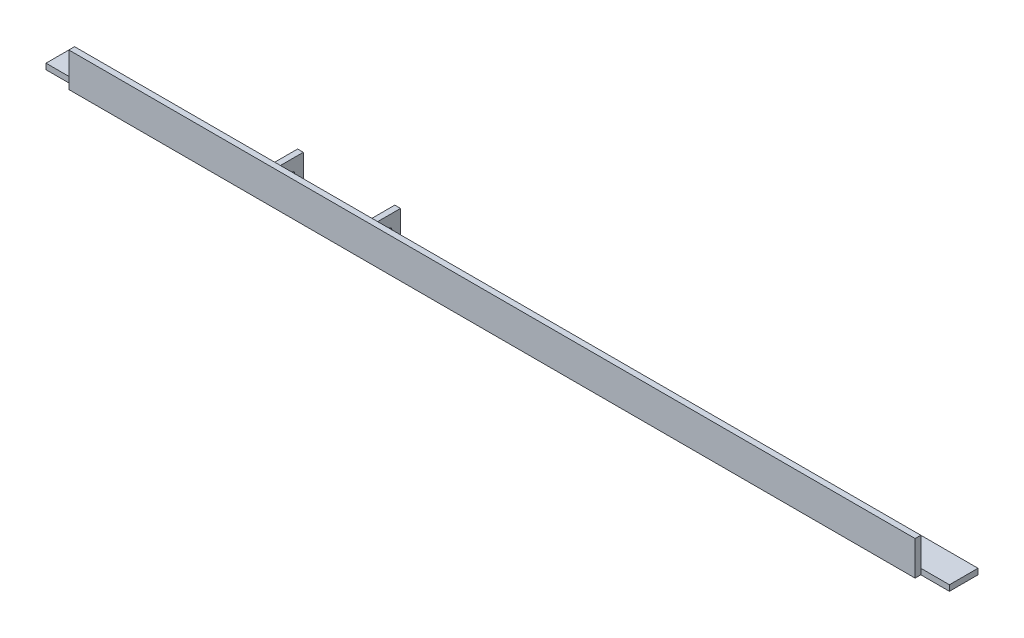
ISO-10303-21;
HEADER;
FILE_DESCRIPTION(('STEP AP214'),'2;1');
FILE_NAME('part.step','',(''),(''),'','','');
FILE_SCHEMA(('AUTOMOTIVE_DESIGN { 1 0 10303 214 1 1 1 1 }'));
ENDSEC;
DATA;
#1=APPLICATION_CONTEXT('core data for automotive mechanical design processes');
#2=APPLICATION_PROTOCOL_DEFINITION('international standard','automotive_design',2000,#1);
#3=PRODUCT_CONTEXT('',#1,'mechanical');
#4=PRODUCT('Part','Part','',(#3));
#5=PRODUCT_RELATED_PRODUCT_CATEGORY('part','',(#4));
#6=PRODUCT_DEFINITION_FORMATION('','',#4);
#7=PRODUCT_DEFINITION_CONTEXT('part definition',#1,'design');
#8=PRODUCT_DEFINITION('design','',#6,#7);
#9=PRODUCT_DEFINITION_SHAPE('','',#8);
#10=(LENGTH_UNIT() NAMED_UNIT(*) SI_UNIT(.MILLI.,.METRE.));
#11=(NAMED_UNIT(*) PLANE_ANGLE_UNIT() SI_UNIT($,.RADIAN.));
#12=(NAMED_UNIT(*) SI_UNIT($,.STERADIAN.) SOLID_ANGLE_UNIT());
#13=UNCERTAINTY_MEASURE_WITH_UNIT(LENGTH_MEASURE(1.E-05),#10,'distance_accuracy_value','');
#14=(GEOMETRIC_REPRESENTATION_CONTEXT(3) GLOBAL_UNCERTAINTY_ASSIGNED_CONTEXT((#13)) GLOBAL_UNIT_ASSIGNED_CONTEXT((#10,
#11,#12)) REPRESENTATION_CONTEXT('',''));
#15=CARTESIAN_POINT('',(0.,0.,0.));
#16=DIRECTION('',(0.,0.,1.));
#17=DIRECTION('',(1.,0.,0.));
#18=AXIS2_PLACEMENT_3D('',#15,#16,#17);
#19=CARTESIAN_POINT('',(1003.3,0.,0.));
#20=DIRECTION('',(-1.,0.,0.));
#21=DIRECTION('',(0.,0.,1.));
#22=AXIS2_PLACEMENT_3D('',#19,#20,#21);
#23=PLANE('',#22);
#24=DIRECTION('',(0.,1.,0.));
#25=VECTOR('',#24,1.);
#26=CARTESIAN_POINT('',(1003.3,-6.35000000000007,0.));
#27=LINE('',#26,#25);
#28=CARTESIAN_POINT('',(1003.3,-6.35,0.));
#29=VERTEX_POINT('',#28);
#30=CARTESIAN_POINT('',(1003.3,1.80411241501588E-13,0.));
#31=VERTEX_POINT('',#30);
#32=EDGE_CURVE('E498',#29,#31,#27,.T.);
#33=ORIENTED_EDGE('',*,*,#32,.F.);
#34=DIRECTION('',(0.,0.,-1.));
#35=VECTOR('',#34,1.);
#36=CARTESIAN_POINT('',(1003.3,-6.34999999999963,-31.75));
#37=LINE('',#36,#35);
#38=CARTESIAN_POINT('',(1003.3,-6.34999999999963,-31.75));
#39=VERTEX_POINT('',#38);
#40=EDGE_CURVE('E421',#29,#39,#37,.T.);
#41=ORIENTED_EDGE('',*,*,#40,.T.);
#42=DIRECTION('',(0.,1.,0.));
#43=VECTOR('',#42,1.);
#44=CARTESIAN_POINT('',(1003.3,3.60822483003176E-13,-31.7499999999999));
#45=LINE('',#44,#43);
#46=CARTESIAN_POINT('',(1003.3,3.60822483003176E-13,-31.7499999999999));
#47=VERTEX_POINT('',#46);
#48=EDGE_CURVE('E423',#39,#47,#45,.T.);
#49=ORIENTED_EDGE('',*,*,#48,.T.);
#50=DIRECTION('',(0.,0.,1.));
#51=VECTOR('',#50,1.);
#52=CARTESIAN_POINT('',(1003.3,0.,0.));
#53=LINE('',#52,#51);
#54=EDGE_CURVE('E230',#47,#31,#53,.T.);
#55=ORIENTED_EDGE('',*,*,#54,.T.);
#56=EDGE_LOOP('',(#33,#41,#49,#55));
#57=FACE_BOUND('',#56,.T.);
#58=ADVANCED_FACE('F44',(#57),#23,.F.);
#59=CARTESIAN_POINT('',(0.,0.,0.));
#60=DIRECTION('',(-1.,0.,0.));
#61=DIRECTION('',(0.,0.,1.));
#62=AXIS2_PLACEMENT_3D('',#59,#60,#61);
#63=PLANE('',#62);
#64=DIRECTION('',(0.,0.,-1.));
#65=VECTOR('',#64,1.);
#66=CARTESIAN_POINT('',(0.,-6.34999999999963,-31.75));
#67=LINE('',#66,#65);
#68=CARTESIAN_POINT('',(0.,-6.35000000000007,0.));
#69=VERTEX_POINT('',#68);
#70=CARTESIAN_POINT('',(0.,-6.34999999999963,-31.75));
#71=VERTEX_POINT('',#70);
#72=EDGE_CURVE('E214',#69,#71,#67,.T.);
#73=ORIENTED_EDGE('',*,*,#72,.F.);
#74=DIRECTION('',(0.,1.,0.));
#75=VECTOR('',#74,1.);
#76=CARTESIAN_POINT('',(0.,0.,0.));
#77=LINE('',#76,#75);
#78=CARTESIAN_POINT('',(0.,0.,0.));
#79=VERTEX_POINT('',#78);
#80=EDGE_CURVE('E11',#69,#79,#77,.T.);
#81=ORIENTED_EDGE('',*,*,#80,.T.);
#82=DIRECTION('',(0.,0.,1.));
#83=VECTOR('',#82,1.);
#84=CARTESIAN_POINT('',(0.,0.,0.));
#85=LINE('',#84,#83);
#86=CARTESIAN_POINT('',(0.,3.60822483003176E-13,-31.7499999999999));
#87=VERTEX_POINT('',#86);
#88=EDGE_CURVE('E226',#87,#79,#85,.T.);
#89=ORIENTED_EDGE('',*,*,#88,.F.);
#90=DIRECTION('',(0.,1.,0.));
#91=VECTOR('',#90,1.);
#92=CARTESIAN_POINT('',(0.,3.60822483003176E-13,-31.7499999999999));
#93=LINE('',#92,#91);
#94=EDGE_CURVE('E224',#71,#87,#93,.T.);
#95=ORIENTED_EDGE('',*,*,#94,.F.);
#96=EDGE_LOOP('',(#73,#81,#89,#95));
#97=FACE_BOUND('',#96,.T.);
#98=ADVANCED_FACE('F222',(#97),#63,.T.);
#99=CARTESIAN_POINT('',(1003.3,3.60822483003176E-13,-31.7499999999999));
#100=DIRECTION('',(0.,0.,1.));
#101=DIRECTION('',(0.,-1.,0.));
#102=AXIS2_PLACEMENT_3D('',#99,#100,#101);
#103=PLANE('',#102);
#104=DIRECTION('',(0.,-1.,0.));
#105=VECTOR('',#104,1.);
#106=CARTESIAN_POINT('',(254.,25.4000000000004,-31.7499999999996));
#107=LINE('',#106,#105);
#108=CARTESIAN_POINT('',(254.,25.4000000000004,-31.7499999999996));
#109=VERTEX_POINT('',#108);
#110=CARTESIAN_POINT('',(254.,-6.35000000000007,-31.75));
#111=VERTEX_POINT('',#110);
#112=EDGE_CURVE('E412',#109,#111,#107,.T.);
#113=ORIENTED_EDGE('',*,*,#112,.T.);
#114=DIRECTION('',(-1.,0.,0.));
#115=VECTOR('',#114,1.);
#116=CARTESIAN_POINT('',(1003.3,-6.34999999999963,-31.75));
#117=LINE('',#116,#115);
#118=EDGE_CURVE('E239',#111,#71,#117,.T.);
#119=ORIENTED_EDGE('',*,*,#118,.T.);
#120=ORIENTED_EDGE('',*,*,#94,.T.);
#121=DIRECTION('',(-1.,0.,0.));
#122=VECTOR('',#121,1.);
#123=CARTESIAN_POINT('',(1003.3,3.60822483003176E-13,-31.7499999999999));
#124=LINE('',#123,#122);
#125=CARTESIAN_POINT('',(247.65,3.60822483003176E-13,-31.7499999999999));
#126=VERTEX_POINT('',#125);
#127=EDGE_CURVE('E240',#126,#87,#124,.T.);
#128=ORIENTED_EDGE('',*,*,#127,.F.);
#129=DIRECTION('',(0.,-1.,0.));
#130=VECTOR('',#129,1.);
#131=CARTESIAN_POINT('',(247.65,25.4000000000004,-31.7499999999996));
#132=LINE('',#131,#130);
#133=CARTESIAN_POINT('',(247.65,25.4000000000004,-31.7499999999996));
#134=VERTEX_POINT('',#133);
#135=EDGE_CURVE('E408',#134,#126,#132,.T.);
#136=ORIENTED_EDGE('',*,*,#135,.F.);
#137=DIRECTION('',(-1.,0.,0.));
#138=VECTOR('',#137,1.);
#139=CARTESIAN_POINT('',(247.65,25.4000000000004,-31.7499999999996));
#140=LINE('',#139,#138);
#141=EDGE_CURVE('E370',#109,#134,#140,.T.);
#142=ORIENTED_EDGE('',*,*,#141,.F.);
#143=EDGE_LOOP('',(#113,#119,#120,#128,#136,#142));
#144=FACE_BOUND('',#143,.T.);
#145=ADVANCED_FACE('F434',(#144),#103,.F.);
#146=CARTESIAN_POINT('',(1003.3,0.,0.));
#147=DIRECTION('',(0.,-1.,0.));
#148=DIRECTION('',(0.,0.,-1.));
#149=AXIS2_PLACEMENT_3D('',#146,#147,#148);
#150=PLANE('',#149);
#151=DIRECTION('',(0.,0.,1.));
#152=VECTOR('',#151,1.);
#153=CARTESIAN_POINT('',(355.6,3.60822483003176E-13,-31.7499999999999));
#154=LINE('',#153,#152);
#155=CARTESIAN_POINT('',(355.6,1.4432899320127E-13,-12.6999999999999));
#156=VERTEX_POINT('',#155);
#157=CARTESIAN_POINT('',(355.6,0.,0.));
#158=VERTEX_POINT('',#157);
#159=EDGE_CURVE('E340',#156,#158,#154,.T.);
#160=ORIENTED_EDGE('',*,*,#159,.F.);
#161=DIRECTION('',(1.,0.,0.));
#162=VECTOR('',#161,1.);
#163=CARTESIAN_POINT('',(254.,1.4432899320127E-13,-12.6999999999999));
#164=LINE('',#163,#162);
#165=CARTESIAN_POINT('',(254.,1.4432899320127E-13,-12.6999999999999));
#166=VERTEX_POINT('',#165);
#167=EDGE_CURVE('E68',#166,#156,#164,.T.);
#168=ORIENTED_EDGE('',*,*,#167,.F.);
#169=DIRECTION('',(0.,0.,-1.));
#170=VECTOR('',#169,1.);
#171=CARTESIAN_POINT('',(254.,3.60822483003176E-13,-31.7499999999999));
#172=LINE('',#171,#170);
#173=CARTESIAN_POINT('',(254.,0.,0.));
#174=VERTEX_POINT('',#173);
#175=EDGE_CURVE('E343',#174,#166,#172,.T.);
#176=ORIENTED_EDGE('',*,*,#175,.F.);
#177=DIRECTION('',(-1.,0.,0.));
#178=VECTOR('',#177,1.);
#179=CARTESIAN_POINT('',(1003.3,0.,0.));
#180=LINE('',#179,#178);
#181=EDGE_CURVE('E442',#158,#174,#180,.T.);
#182=ORIENTED_EDGE('',*,*,#181,.F.);
#183=EDGE_LOOP('',(#160,#168,#176,#182));
#184=FACE_BOUND('',#183,.T.);
#185=ADVANCED_FACE('F46',(#184),#150,.F.);
#186=DIRECTION('',(0.,0.,-1.));
#187=VECTOR('',#186,1.);
#188=CARTESIAN_POINT('',(387.35,0.,-6.3499999999999));
#189=LINE('',#188,#187);
#190=CARTESIAN_POINT('',(387.35,0.,0.));
#191=VERTEX_POINT('',#190);
#192=CARTESIAN_POINT('',(387.35,0.,-6.3499999999999));
#193=VERTEX_POINT('',#192);
#194=EDGE_CURVE('E336',#191,#193,#189,.T.);
#195=ORIENTED_EDGE('',*,*,#194,.F.);
#196=CARTESIAN_POINT('',(971.55,0.,0.));
#197=VERTEX_POINT('',#196);
#198=EDGE_CURVE('E258',#197,#191,#180,.T.);
#199=ORIENTED_EDGE('',*,*,#198,.F.);
#200=EDGE_CURVE('E53',#31,#197,#180,.T.);
#201=ORIENTED_EDGE('',*,*,#200,.F.);
#202=ORIENTED_EDGE('',*,*,#54,.F.);
#203=CARTESIAN_POINT('',(361.95,3.60822483003176E-13,-31.7499999999999));
#204=VERTEX_POINT('',#203);
#205=EDGE_CURVE('E236',#47,#204,#124,.T.);
#206=ORIENTED_EDGE('',*,*,#205,.T.);
#207=DIRECTION('',(0.,0.,-1.));
#208=VECTOR('',#207,1.);
#209=CARTESIAN_POINT('',(361.95,3.60822483003176E-13,-31.7499999999999));
#210=LINE('',#209,#208);
#211=CARTESIAN_POINT('',(361.95,0.,-6.34999999999971));
#212=VERTEX_POINT('',#211);
#213=EDGE_CURVE('E327',#212,#204,#210,.T.);
#214=ORIENTED_EDGE('',*,*,#213,.F.);
#215=DIRECTION('',(-1.,0.,0.));
#216=VECTOR('',#215,1.);
#217=CARTESIAN_POINT('',(387.35,0.,-6.3499999999999));
#218=LINE('',#217,#216);
#219=EDGE_CURVE('E331',#193,#212,#218,.T.);
#220=ORIENTED_EDGE('',*,*,#219,.F.);
#221=EDGE_LOOP('',(#195,#199,#201,#202,#206,#214,#220));
#222=FACE_BOUND('',#221,.T.);
#223=ADVANCED_FACE('F453',(#222),#150,.F.);
#224=CARTESIAN_POINT('',(1003.3,0.,0.));
#225=DIRECTION('',(0.,0.,1.));
#226=DIRECTION('',(0.,-1.,0.));
#227=AXIS2_PLACEMENT_3D('',#224,#225,#226);
#228=PLANE('',#227);
#229=CARTESIAN_POINT('',(222.25,0.,0.));
#230=VERTEX_POINT('',#229);
#231=CARTESIAN_POINT('',(31.75,0.,0.));
#232=VERTEX_POINT('',#231);
#233=EDGE_CURVE('E256',#230,#232,#180,.T.);
#234=ORIENTED_EDGE('',*,*,#233,.T.);
#235=DIRECTION('',(0.,1.,0.));
#236=VECTOR('',#235,1.);
#237=CARTESIAN_POINT('',(31.75,31.7499999999999,0.));
#238=LINE('',#237,#236);
#239=CARTESIAN_POINT('',(31.75,31.7499999999999,0.));
#240=VERTEX_POINT('',#239);
#241=EDGE_CURVE('E218',#232,#240,#238,.T.);
#242=ORIENTED_EDGE('',*,*,#241,.T.);
#243=DIRECTION('',(-1.,0.,0.));
#244=VECTOR('',#243,1.);
#245=CARTESIAN_POINT('',(1003.3,31.7499999999999,0.));
#246=LINE('',#245,#244);
#247=CARTESIAN_POINT('',(971.55,31.7499999999999,0.));
#248=VERTEX_POINT('',#247);
#249=EDGE_CURVE('E252',#248,#240,#246,.T.);
#250=ORIENTED_EDGE('',*,*,#249,.F.);
#251=DIRECTION('',(0.,-1.,0.));
#252=VECTOR('',#251,1.);
#253=CARTESIAN_POINT('',(971.55,-6.35000000000007,0.));
#254=LINE('',#253,#252);
#255=EDGE_CURVE('E450',#248,#197,#254,.T.);
#256=ORIENTED_EDGE('',*,*,#255,.T.);
#257=ORIENTED_EDGE('',*,*,#198,.T.);
#258=DIRECTION('',(0.,-1.,0.));
#259=VECTOR('',#258,1.);
#260=CARTESIAN_POINT('',(387.35,25.4,3.86400264115041E-13));
#261=LINE('',#260,#259);
#262=CARTESIAN_POINT('',(387.35,25.4,0.));
#263=VERTEX_POINT('',#262);
#264=EDGE_CURVE('E307',#263,#191,#261,.T.);
#265=ORIENTED_EDGE('',*,*,#264,.F.);
#266=DIRECTION('',(1.,0.,0.));
#267=VECTOR('',#266,1.);
#268=CARTESIAN_POINT('',(387.35,25.4,3.86400264115041E-13));
#269=LINE('',#268,#267);
#270=CARTESIAN_POINT('',(355.6,25.4,0.));
#271=VERTEX_POINT('',#270);
#272=EDGE_CURVE('E355',#271,#263,#269,.T.);
#273=ORIENTED_EDGE('',*,*,#272,.F.);
#274=DIRECTION('',(0.,-1.,0.));
#275=VECTOR('',#274,1.);
#276=CARTESIAN_POINT('',(355.6,25.4,2.76215574923204E-13));
#277=LINE('',#276,#275);
#278=EDGE_CURVE('E301',#271,#158,#277,.T.);
#279=ORIENTED_EDGE('',*,*,#278,.T.);
#280=ORIENTED_EDGE('',*,*,#181,.T.);
#281=DIRECTION('',(0.,-1.,0.));
#282=VECTOR('',#281,1.);
#283=CARTESIAN_POINT('',(254.,25.4,2.88657986402541E-13));
#284=LINE('',#283,#282);
#285=CARTESIAN_POINT('',(254.,25.4,0.));
#286=VERTEX_POINT('',#285);
#287=EDGE_CURVE('E232',#286,#174,#284,.T.);
#288=ORIENTED_EDGE('',*,*,#287,.F.);
#289=DIRECTION('',(1.,0.,0.));
#290=VECTOR('',#289,1.);
#291=CARTESIAN_POINT('',(222.25,25.4,3.78863607153335E-13));
#292=LINE('',#291,#290);
#293=CARTESIAN_POINT('',(222.25,25.4,0.));
#294=VERTEX_POINT('',#293);
#295=EDGE_CURVE('E362',#294,#286,#292,.T.);
#296=ORIENTED_EDGE('',*,*,#295,.F.);
#297=DIRECTION('',(0.,-1.,0.));
#298=VECTOR('',#297,1.);
#299=CARTESIAN_POINT('',(222.25,25.4,3.78863607153335E-13));
#300=LINE('',#299,#298);
#301=EDGE_CURVE('E383',#294,#230,#300,.T.);
#302=ORIENTED_EDGE('',*,*,#301,.T.);
#303=EDGE_LOOP('',(#234,#242,#250,#256,#257,#265,#273,#279,#280,#288,#296,#302));
#304=FACE_BOUND('',#303,.T.);
#305=ADVANCED_FACE('F448',(#304),#228,.F.);
#306=DIRECTION('',(0.,0.,1.));
#307=VECTOR('',#306,1.);
#308=CARTESIAN_POINT('',(247.65,3.60822483003176E-13,-31.7499999999999));
#309=LINE('',#308,#307);
#310=CARTESIAN_POINT('',(247.65,0.,-6.34999999999998));
#311=VERTEX_POINT('',#310);
#312=EDGE_CURVE('E387',#126,#311,#309,.T.);
#313=ORIENTED_EDGE('',*,*,#312,.F.);
#314=ORIENTED_EDGE('',*,*,#127,.T.);
#315=ORIENTED_EDGE('',*,*,#88,.T.);
#316=DIRECTION('',(-1.,0.,0.));
#317=VECTOR('',#316,1.);
#318=CARTESIAN_POINT('',(1003.3,0.,0.));
#319=LINE('',#318,#317);
#320=EDGE_CURVE('E205',#232,#79,#319,.T.);
#321=ORIENTED_EDGE('',*,*,#320,.F.);
#322=ORIENTED_EDGE('',*,*,#233,.F.);
#323=DIRECTION('',(0.,0.,1.));
#324=VECTOR('',#323,1.);
#325=CARTESIAN_POINT('',(222.25,0.,-6.3499999999999));
#326=LINE('',#325,#324);
#327=CARTESIAN_POINT('',(222.25,0.,-6.3499999999999));
#328=VERTEX_POINT('',#327);
#329=EDGE_CURVE('E367',#328,#230,#326,.T.);
#330=ORIENTED_EDGE('',*,*,#329,.F.);
#331=DIRECTION('',(-1.,0.,0.));
#332=VECTOR('',#331,1.);
#333=CARTESIAN_POINT('',(222.25,0.,-6.3499999999999));
#334=LINE('',#333,#332);
#335=EDGE_CURVE('E391',#311,#328,#334,.T.);
#336=ORIENTED_EDGE('',*,*,#335,.F.);
#337=EDGE_LOOP('',(#313,#314,#315,#321,#322,#330,#336));
#338=FACE_BOUND('',#337,.T.);
#339=ADVANCED_FACE('F431',(#338),#150,.F.);
#340=CARTESIAN_POINT('',(1003.3,31.7499999999999,0.));
#341=DIRECTION('',(0.,-1.,0.));
#342=DIRECTION('',(0.,0.,-1.));
#343=AXIS2_PLACEMENT_3D('',#340,#341,#342);
#344=PLANE('',#343);
#345=ORIENTED_EDGE('',*,*,#249,.T.);
#346=DIRECTION('',(0.,0.,1.));
#347=VECTOR('',#346,1.);
#348=CARTESIAN_POINT('',(31.75,31.7499999999999,0.));
#349=LINE('',#348,#347);
#350=CARTESIAN_POINT('',(31.75,31.7499999999999,6.35));
#351=VERTEX_POINT('',#350);
#352=EDGE_CURVE('E276',#240,#351,#349,.T.);
#353=ORIENTED_EDGE('',*,*,#352,.T.);
#354=DIRECTION('',(-1.,0.,0.));
#355=VECTOR('',#354,1.);
#356=CARTESIAN_POINT('',(1003.3,31.7499999999999,6.35));
#357=LINE('',#356,#355);
#358=CARTESIAN_POINT('',(971.55,31.7499999999999,6.35));
#359=VERTEX_POINT('',#358);
#360=EDGE_CURVE('E248',#359,#351,#357,.T.);
#361=ORIENTED_EDGE('',*,*,#360,.F.);
#362=DIRECTION('',(0.,0.,1.));
#363=VECTOR('',#362,1.);
#364=CARTESIAN_POINT('',(971.55,31.7499999999999,0.));
#365=LINE('',#364,#363);
#366=EDGE_CURVE('E509',#248,#359,#365,.T.);
#367=ORIENTED_EDGE('',*,*,#366,.F.);
#368=EDGE_LOOP('',(#345,#353,#361,#367));
#369=FACE_BOUND('',#368,.T.);
#370=ADVANCED_FACE('F530',(#369),#344,.F.);
#371=CARTESIAN_POINT('',(1003.3,31.7499999999999,6.35));
#372=DIRECTION('',(0.,0.,-1.));
#373=DIRECTION('',(-1.,0.,0.));
#374=AXIS2_PLACEMENT_3D('',#371,#372,#373);
#375=PLANE('',#374);
#376=ORIENTED_EDGE('',*,*,#360,.T.);
#377=DIRECTION('',(0.,1.,0.));
#378=VECTOR('',#377,1.);
#379=CARTESIAN_POINT('',(31.75,31.7499999999999,6.35));
#380=LINE('',#379,#378);
#381=CARTESIAN_POINT('',(31.7499999999999,-6.35000000000007,6.35));
#382=VERTEX_POINT('',#381);
#383=EDGE_CURVE('E219',#382,#351,#380,.T.);
#384=ORIENTED_EDGE('',*,*,#383,.F.);
#385=DIRECTION('',(-1.,0.,0.));
#386=VECTOR('',#385,1.);
#387=CARTESIAN_POINT('',(1003.3,-6.35000000000007,6.35));
#388=LINE('',#387,#386);
#389=CARTESIAN_POINT('',(971.55,-6.35000000000007,6.35));
#390=VERTEX_POINT('',#389);
#391=EDGE_CURVE('E245',#390,#382,#388,.T.);
#392=ORIENTED_EDGE('',*,*,#391,.F.);
#393=DIRECTION('',(0.,-1.,0.));
#394=VECTOR('',#393,1.);
#395=CARTESIAN_POINT('',(971.55,-6.35000000000007,6.35));
#396=LINE('',#395,#394);
#397=EDGE_CURVE('E501',#359,#390,#396,.T.);
#398=ORIENTED_EDGE('',*,*,#397,.F.);
#399=EDGE_LOOP('',(#376,#384,#392,#398));
#400=FACE_BOUND('',#399,.T.);
#401=ADVANCED_FACE('F539',(#400),#375,.F.);
#402=CARTESIAN_POINT('',(1003.3,-6.34999999999963,-31.75));
#403=DIRECTION('',(0.,1.,0.));
#404=DIRECTION('',(0.,0.,1.));
#405=AXIS2_PLACEMENT_3D('',#402,#403,#404);
#406=PLANE('',#405);
#407=ORIENTED_EDGE('',*,*,#391,.T.);
#408=DIRECTION('',(0.,0.,1.));
#409=VECTOR('',#408,1.);
#410=CARTESIAN_POINT('',(31.7499999999999,-6.35000000000007,0.));
#411=LINE('',#410,#409);
#412=CARTESIAN_POINT('',(31.7499999999999,-6.35000000000007,0.));
#413=VERTEX_POINT('',#412);
#414=EDGE_CURVE('E216',#413,#382,#411,.T.);
#415=ORIENTED_EDGE('',*,*,#414,.F.);
#416=DIRECTION('',(1.,0.,0.));
#417=VECTOR('',#416,1.);
#418=CARTESIAN_POINT('',(0.,-6.35000000000007,0.));
#419=LINE('',#418,#417);
#420=EDGE_CURVE('E202',#69,#413,#419,.T.);
#421=ORIENTED_EDGE('',*,*,#420,.F.);
#422=ORIENTED_EDGE('',*,*,#72,.T.);
#423=ORIENTED_EDGE('',*,*,#118,.F.);
#424=DIRECTION('',(0.,0.,1.));
#425=VECTOR('',#424,1.);
#426=CARTESIAN_POINT('',(254.,-6.35000000000007,-31.75));
#427=LINE('',#426,#425);
#428=CARTESIAN_POINT('',(254.,-6.35000000000029,-12.7));
#429=VERTEX_POINT('',#428);
#430=EDGE_CURVE('E283',#111,#429,#427,.T.);
#431=ORIENTED_EDGE('',*,*,#430,.T.);
#432=DIRECTION('',(1.,0.,0.));
#433=VECTOR('',#432,1.);
#434=CARTESIAN_POINT('',(254.,-6.35000000000029,-12.7));
#435=LINE('',#434,#433);
#436=CARTESIAN_POINT('',(355.6,-6.35000000000029,-12.7));
#437=VERTEX_POINT('',#436);
#438=EDGE_CURVE('E287',#429,#437,#435,.T.);
#439=ORIENTED_EDGE('',*,*,#438,.T.);
#440=DIRECTION('',(0.,0.,-1.));
#441=VECTOR('',#440,1.);
#442=CARTESIAN_POINT('',(355.6,-6.35000000000007,-31.75));
#443=LINE('',#442,#441);
#444=CARTESIAN_POINT('',(355.6,-6.35000000000007,-31.75));
#445=VERTEX_POINT('',#444);
#446=EDGE_CURVE('E291',#437,#445,#443,.T.);
#447=ORIENTED_EDGE('',*,*,#446,.T.);
#448=EDGE_CURVE('E241',#39,#445,#117,.T.);
#449=ORIENTED_EDGE('',*,*,#448,.F.);
#450=ORIENTED_EDGE('',*,*,#40,.F.);
#451=DIRECTION('',(1.,0.,0.));
#452=VECTOR('',#451,1.);
#453=CARTESIAN_POINT('',(1003.3,-6.35000000000007,0.));
#454=LINE('',#453,#452);
#455=CARTESIAN_POINT('',(971.55,-6.35000000000007,0.));
#456=VERTEX_POINT('',#455);
#457=EDGE_CURVE('E60',#456,#29,#454,.T.);
#458=ORIENTED_EDGE('',*,*,#457,.F.);
#459=DIRECTION('',(0.,0.,1.));
#460=VECTOR('',#459,1.);
#461=CARTESIAN_POINT('',(971.55,-6.35000000000007,0.));
#462=LINE('',#461,#460);
#463=EDGE_CURVE('E511',#456,#390,#462,.T.);
#464=ORIENTED_EDGE('',*,*,#463,.T.);
#465=EDGE_LOOP('',(#407,#415,#421,#422,#423,#431,#439,#447,#449,#450,#458,#464));
#466=FACE_BOUND('',#465,.T.);
#467=ADVANCED_FACE('F212',(#466),#406,.F.);
#468=ORIENTED_EDGE('',*,*,#448,.T.);
#469=DIRECTION('',(0.,-1.,0.));
#470=VECTOR('',#469,1.);
#471=CARTESIAN_POINT('',(355.6,25.4000000000004,-31.7499999999997));
#472=LINE('',#471,#470);
#473=CARTESIAN_POINT('',(355.6,25.4000000000004,-31.7499999999997));
#474=VERTEX_POINT('',#473);
#475=EDGE_CURVE('E323',#474,#445,#472,.T.);
#476=ORIENTED_EDGE('',*,*,#475,.F.);
#477=DIRECTION('',(-1.,0.,0.));
#478=VECTOR('',#477,1.);
#479=CARTESIAN_POINT('',(361.95,25.4000000000004,-31.7499999999997));
#480=LINE('',#479,#478);
#481=CARTESIAN_POINT('',(361.95,25.4000000000004,-31.7499999999997));
#482=VERTEX_POINT('',#481);
#483=EDGE_CURVE('E326',#482,#474,#480,.T.);
#484=ORIENTED_EDGE('',*,*,#483,.F.);
#485=DIRECTION('',(0.,-1.,0.));
#486=VECTOR('',#485,1.);
#487=CARTESIAN_POINT('',(361.95,25.4000000000004,-31.7499999999997));
#488=LINE('',#487,#486);
#489=EDGE_CURVE('E319',#482,#204,#488,.T.);
#490=ORIENTED_EDGE('',*,*,#489,.T.);
#491=ORIENTED_EDGE('',*,*,#205,.F.);
#492=ORIENTED_EDGE('',*,*,#48,.F.);
#493=EDGE_LOOP('',(#468,#476,#484,#490,#491,#492));
#494=FACE_BOUND('',#493,.T.);
#495=ADVANCED_FACE('F495',(#494),#103,.F.);
#496=CARTESIAN_POINT('',(254.,25.4000000000004,-31.7499999999996));
#497=DIRECTION('',(-1.,0.,0.));
#498=DIRECTION('',(0.,0.,1.));
#499=AXIS2_PLACEMENT_3D('',#496,#497,#498);
#500=PLANE('',#499);
#501=CARTESIAN_POINT('',(254.,9.52500000000036,-19.0499999999996));
#502=DIRECTION('',(-1.,0.,0.));
#503=DIRECTION('',(0.,0.,1.));
#504=AXIS2_PLACEMENT_3D('',#501,#502,#503);
#505=CIRCLE('',#504,3.175);
#506=CARTESIAN_POINT('',(254.,9.52500000000036,-15.8749999999996));
#507=VERTEX_POINT('',#506);
#508=EDGE_CURVE('E269',#507,#507,#505,.T.);
#509=ORIENTED_EDGE('',*,*,#508,.T.);
#510=EDGE_LOOP('',(#509));
#511=FACE_BOUND('',#510,.T.);
#512=ORIENTED_EDGE('',*,*,#175,.T.);
#513=DIRECTION('',(0.,1.,0.));
#514=VECTOR('',#513,1.);
#515=CARTESIAN_POINT('',(254.,-6.35000000000029,-12.7));
#516=LINE('',#515,#514);
#517=EDGE_CURVE('E295',#429,#166,#516,.T.);
#518=ORIENTED_EDGE('',*,*,#517,.F.);
#519=ORIENTED_EDGE('',*,*,#430,.F.);
#520=ORIENTED_EDGE('',*,*,#112,.F.);
#521=DIRECTION('',(0.,0.,-1.));
#522=VECTOR('',#521,1.);
#523=CARTESIAN_POINT('',(254.,25.4000000000004,-31.7499999999996));
#524=LINE('',#523,#522);
#525=EDGE_CURVE('E366',#286,#109,#524,.T.);
#526=ORIENTED_EDGE('',*,*,#525,.F.);
#527=ORIENTED_EDGE('',*,*,#287,.T.);
#528=EDGE_LOOP('',(#512,#518,#519,#520,#526,#527));
#529=FACE_BOUND('',#528,.T.);
#530=ADVANCED_FACE('F471',(#511,#529),#500,.F.);
#531=CARTESIAN_POINT('',(247.65,25.4000000000004,-31.7499999999996));
#532=DIRECTION('',(1.,0.,0.));
#533=DIRECTION('',(0.,0.,-1.));
#534=AXIS2_PLACEMENT_3D('',#531,#532,#533);
#535=PLANE('',#534);
#536=CARTESIAN_POINT('',(247.65,9.52500000000036,-19.0499999999996));
#537=DIRECTION('',(-1.,0.,0.));
#538=DIRECTION('',(0.,0.,1.));
#539=AXIS2_PLACEMENT_3D('',#536,#537,#538);
#540=CIRCLE('',#539,3.175);
#541=CARTESIAN_POINT('',(247.65,9.52500000000036,-15.8749999999996));
#542=VERTEX_POINT('',#541);
#543=EDGE_CURVE('E263',#542,#542,#540,.T.);
#544=ORIENTED_EDGE('',*,*,#543,.F.);
#545=EDGE_LOOP('',(#544));
#546=FACE_BOUND('',#545,.T.);
#547=ORIENTED_EDGE('',*,*,#312,.T.);
#548=DIRECTION('',(0.,-1.,0.));
#549=VECTOR('',#548,1.);
#550=CARTESIAN_POINT('',(247.65,25.4000000000001,-6.34999999999969));
#551=LINE('',#550,#549);
#552=CARTESIAN_POINT('',(247.65,25.4000000000001,-6.34999999999969));
#553=VERTEX_POINT('',#552);
#554=EDGE_CURVE('E404',#553,#311,#551,.T.);
#555=ORIENTED_EDGE('',*,*,#554,.F.);
#556=DIRECTION('',(0.,0.,1.));
#557=VECTOR('',#556,1.);
#558=CARTESIAN_POINT('',(247.65,25.4000000000004,-31.7499999999996));
#559=LINE('',#558,#557);
#560=EDGE_CURVE('E373',#134,#553,#559,.T.);
#561=ORIENTED_EDGE('',*,*,#560,.F.);
#562=ORIENTED_EDGE('',*,*,#135,.T.);
#563=EDGE_LOOP('',(#547,#555,#561,#562));
#564=FACE_BOUND('',#563,.T.);
#565=ADVANCED_FACE('F486',(#546,#564),#535,.F.);
#566=CARTESIAN_POINT('',(222.25,25.4000000000001,-6.34999999999961));
#567=DIRECTION('',(0.,0.,1.));
#568=DIRECTION('',(0.,-1.,0.));
#569=AXIS2_PLACEMENT_3D('',#566,#567,#568);
#570=PLANE('',#569);
#571=ORIENTED_EDGE('',*,*,#335,.T.);
#572=DIRECTION('',(0.,-1.,0.));
#573=VECTOR('',#572,1.);
#574=CARTESIAN_POINT('',(222.25,25.4000000000001,-6.34999999999961));
#575=LINE('',#574,#573);
#576=CARTESIAN_POINT('',(222.25,25.4000000000001,-6.34999999999961));
#577=VERTEX_POINT('',#576);
#578=EDGE_CURVE('E400',#577,#328,#575,.T.);
#579=ORIENTED_EDGE('',*,*,#578,.F.);
#580=DIRECTION('',(-1.,0.,0.));
#581=VECTOR('',#580,1.);
#582=CARTESIAN_POINT('',(222.25,25.4000000000001,-6.34999999999961));
#583=LINE('',#582,#581);
#584=EDGE_CURVE('E376',#553,#577,#583,.T.);
#585=ORIENTED_EDGE('',*,*,#584,.F.);
#586=ORIENTED_EDGE('',*,*,#554,.T.);
#587=EDGE_LOOP('',(#571,#579,#585,#586));
#588=FACE_BOUND('',#587,.T.);
#589=ADVANCED_FACE('F482',(#588),#570,.F.);
#590=CARTESIAN_POINT('',(222.25,25.4000000000001,-6.34999999999961));
#591=DIRECTION('',(1.,0.,0.));
#592=DIRECTION('',(0.,0.,-1.));
#593=AXIS2_PLACEMENT_3D('',#590,#591,#592);
#594=PLANE('',#593);
#595=ORIENTED_EDGE('',*,*,#329,.T.);
#596=ORIENTED_EDGE('',*,*,#301,.F.);
#597=DIRECTION('',(0.,0.,1.));
#598=VECTOR('',#597,1.);
#599=CARTESIAN_POINT('',(222.25,25.4000000000001,-6.34999999999961));
#600=LINE('',#599,#598);
#601=EDGE_CURVE('E379',#577,#294,#600,.T.);
#602=ORIENTED_EDGE('',*,*,#601,.F.);
#603=ORIENTED_EDGE('',*,*,#578,.T.);
#604=EDGE_LOOP('',(#595,#596,#602,#603));
#605=FACE_BOUND('',#604,.T.);
#606=ADVANCED_FACE('F480',(#605),#594,.F.);
#607=CARTESIAN_POINT('',(0.,25.4,2.88657986402541E-13));
#608=DIRECTION('',(0.,-1.,0.));
#609=DIRECTION('',(0.,0.,-1.));
#610=AXIS2_PLACEMENT_3D('',#607,#608,#609);
#611=PLANE('',#610);
#612=ORIENTED_EDGE('',*,*,#295,.T.);
#613=ORIENTED_EDGE('',*,*,#525,.T.);
#614=ORIENTED_EDGE('',*,*,#141,.T.);
#615=ORIENTED_EDGE('',*,*,#560,.T.);
#616=ORIENTED_EDGE('',*,*,#584,.T.);
#617=ORIENTED_EDGE('',*,*,#601,.T.);
#618=EDGE_LOOP('',(#612,#613,#614,#615,#616,#617));
#619=FACE_BOUND('',#618,.T.);
#620=ADVANCED_FACE('F476',(#619),#611,.F.);
#621=CARTESIAN_POINT('',(355.6,25.4000000000004,-31.7499999999997));
#622=DIRECTION('',(1.,0.,0.));
#623=DIRECTION('',(0.,0.,-1.));
#624=AXIS2_PLACEMENT_3D('',#621,#622,#623);
#625=PLANE('',#624);
#626=CARTESIAN_POINT('',(355.6,9.52500000000036,-19.0499999999996));
#627=DIRECTION('',(1.,0.,0.));
#628=DIRECTION('',(0.,0.,-1.));
#629=AXIS2_PLACEMENT_3D('',#626,#627,#628);
#630=CIRCLE('',#629,3.175);
#631=CARTESIAN_POINT('',(355.6,9.52500000000036,-22.2249999999996));
#632=VERTEX_POINT('',#631);
#633=EDGE_CURVE('E262',#632,#632,#630,.T.);
#634=ORIENTED_EDGE('',*,*,#633,.T.);
#635=EDGE_LOOP('',(#634));
#636=FACE_BOUND('',#635,.T.);
#637=ORIENTED_EDGE('',*,*,#475,.T.);
#638=ORIENTED_EDGE('',*,*,#446,.F.);
#639=DIRECTION('',(0.,1.,0.));
#640=VECTOR('',#639,1.);
#641=CARTESIAN_POINT('',(355.6,-6.35000000000029,-12.7));
#642=LINE('',#641,#640);
#643=EDGE_CURVE('E298',#437,#156,#642,.T.);
#644=ORIENTED_EDGE('',*,*,#643,.T.);
#645=ORIENTED_EDGE('',*,*,#159,.T.);
#646=ORIENTED_EDGE('',*,*,#278,.F.);
#647=DIRECTION('',(0.,0.,1.));
#648=VECTOR('',#647,1.);
#649=CARTESIAN_POINT('',(355.6,25.4000000000004,-31.7499999999997));
#650=LINE('',#649,#648);
#651=EDGE_CURVE('E332',#474,#271,#650,.T.);
#652=ORIENTED_EDGE('',*,*,#651,.F.);
#653=EDGE_LOOP('',(#637,#638,#644,#645,#646,#652));
#654=FACE_BOUND('',#653,.T.);
#655=ADVANCED_FACE('F491',(#636,#654),#625,.F.);
#656=CARTESIAN_POINT('',(387.35,25.4000000000001,-6.34999999999961));
#657=DIRECTION('',(-1.,0.,0.));
#658=DIRECTION('',(0.,0.,1.));
#659=AXIS2_PLACEMENT_3D('',#656,#657,#658);
#660=PLANE('',#659);
#661=ORIENTED_EDGE('',*,*,#194,.T.);
#662=DIRECTION('',(0.,-1.,0.));
#663=VECTOR('',#662,1.);
#664=CARTESIAN_POINT('',(387.35,25.4000000000001,-6.34999999999961));
#665=LINE('',#664,#663);
#666=CARTESIAN_POINT('',(387.35,25.4000000000001,-6.34999999999961));
#667=VERTEX_POINT('',#666);
#668=EDGE_CURVE('E311',#667,#193,#665,.T.);
#669=ORIENTED_EDGE('',*,*,#668,.F.);
#670=DIRECTION('',(0.,0.,-1.));
#671=VECTOR('',#670,1.);
#672=CARTESIAN_POINT('',(387.35,25.4000000000001,-6.34999999999961));
#673=LINE('',#672,#671);
#674=EDGE_CURVE('E352',#263,#667,#673,.T.);
#675=ORIENTED_EDGE('',*,*,#674,.F.);
#676=ORIENTED_EDGE('',*,*,#264,.T.);
#677=EDGE_LOOP('',(#661,#669,#675,#676));
#678=FACE_BOUND('',#677,.T.);
#679=ADVANCED_FACE('F457',(#678),#660,.F.);
#680=CARTESIAN_POINT('',(387.35,25.4000000000001,-6.34999999999961));
#681=DIRECTION('',(0.,0.,1.));
#682=DIRECTION('',(0.,-1.,0.));
#683=AXIS2_PLACEMENT_3D('',#680,#681,#682);
#684=PLANE('',#683);
#685=ORIENTED_EDGE('',*,*,#219,.T.);
#686=DIRECTION('',(0.,-1.,0.));
#687=VECTOR('',#686,1.);
#688=CARTESIAN_POINT('',(361.95,25.4000000000001,-6.34999999999971));
#689=LINE('',#688,#687);
#690=CARTESIAN_POINT('',(361.95,25.4000000000001,-6.34999999999971));
#691=VERTEX_POINT('',#690);
#692=EDGE_CURVE('E315',#691,#212,#689,.T.);
#693=ORIENTED_EDGE('',*,*,#692,.F.);
#694=DIRECTION('',(-1.,0.,0.));
#695=VECTOR('',#694,1.);
#696=CARTESIAN_POINT('',(387.35,25.4000000000001,-6.34999999999961));
#697=LINE('',#696,#695);
#698=EDGE_CURVE('E349',#667,#691,#697,.T.);
#699=ORIENTED_EDGE('',*,*,#698,.F.);
#700=ORIENTED_EDGE('',*,*,#668,.T.);
#701=EDGE_LOOP('',(#685,#693,#699,#700));
#702=FACE_BOUND('',#701,.T.);
#703=ADVANCED_FACE('F548',(#702),#684,.F.);
#704=CARTESIAN_POINT('',(361.95,25.4000000000004,-31.7499999999997));
#705=DIRECTION('',(-1.,0.,0.));
#706=DIRECTION('',(0.,0.,1.));
#707=AXIS2_PLACEMENT_3D('',#704,#705,#706);
#708=PLANE('',#707);
#709=CARTESIAN_POINT('',(361.95,9.52500000000036,-19.0499999999996));
#710=DIRECTION('',(-1.,0.,0.));
#711=DIRECTION('',(0.,0.,1.));
#712=AXIS2_PLACEMENT_3D('',#709,#710,#711);
#713=CIRCLE('',#712,3.175);
#714=CARTESIAN_POINT('',(361.95,9.52500000000036,-15.8749999999996));
#715=VERTEX_POINT('',#714);
#716=EDGE_CURVE('E259',#715,#715,#713,.T.);
#717=ORIENTED_EDGE('',*,*,#716,.T.);
#718=EDGE_LOOP('',(#717));
#719=FACE_BOUND('',#718,.T.);
#720=ORIENTED_EDGE('',*,*,#213,.T.);
#721=ORIENTED_EDGE('',*,*,#489,.F.);
#722=DIRECTION('',(0.,0.,-1.));
#723=VECTOR('',#722,1.);
#724=CARTESIAN_POINT('',(361.95,25.4000000000004,-31.7499999999997));
#725=LINE('',#724,#723);
#726=EDGE_CURVE('E346',#691,#482,#725,.T.);
#727=ORIENTED_EDGE('',*,*,#726,.F.);
#728=ORIENTED_EDGE('',*,*,#692,.T.);
#729=EDGE_LOOP('',(#720,#721,#727,#728));
#730=FACE_BOUND('',#729,.T.);
#731=ADVANCED_FACE('F545',(#719,#730),#708,.F.);
#732=CARTESIAN_POINT('',(0.,25.4,2.88657986402541E-13));
#733=DIRECTION('',(0.,-1.,0.));
#734=DIRECTION('',(0.,0.,-1.));
#735=AXIS2_PLACEMENT_3D('',#732,#733,#734);
#736=PLANE('',#735);
#737=ORIENTED_EDGE('',*,*,#651,.T.);
#738=ORIENTED_EDGE('',*,*,#272,.T.);
#739=ORIENTED_EDGE('',*,*,#674,.T.);
#740=ORIENTED_EDGE('',*,*,#698,.T.);
#741=ORIENTED_EDGE('',*,*,#726,.T.);
#742=ORIENTED_EDGE('',*,*,#483,.T.);
#743=EDGE_LOOP('',(#737,#738,#739,#740,#741,#742));
#744=FACE_BOUND('',#743,.T.);
#745=ADVANCED_FACE('F460',(#744),#736,.F.);
#746=CARTESIAN_POINT('',(254.,-6.35000000000029,-12.7));
#747=DIRECTION('',(0.,0.,1.));
#748=DIRECTION('',(0.,-1.,0.));
#749=AXIS2_PLACEMENT_3D('',#746,#747,#748);
#750=PLANE('',#749);
#751=ORIENTED_EDGE('',*,*,#167,.T.);
#752=ORIENTED_EDGE('',*,*,#643,.F.);
#753=ORIENTED_EDGE('',*,*,#438,.F.);
#754=ORIENTED_EDGE('',*,*,#517,.T.);
#755=EDGE_LOOP('',(#751,#752,#753,#754));
#756=FACE_BOUND('',#755,.T.);
#757=ADVANCED_FACE('F490',(#756),#750,.F.);
#758=CARTESIAN_POINT('',(1003.3,9.52500000000036,-19.0499999999996));
#759=DIRECTION('',(-1.,0.,0.));
#760=DIRECTION('',(0.,0.,1.));
#761=AXIS2_PLACEMENT_3D('',#758,#759,#760);
#762=CYLINDRICAL_SURFACE('',#761,3.175);
#763=ORIENTED_EDGE('',*,*,#716,.F.);
#764=EDGE_LOOP('',(#763));
#765=FACE_BOUND('',#764,.T.);
#766=ORIENTED_EDGE('',*,*,#633,.F.);
#767=EDGE_LOOP('',(#766));
#768=FACE_BOUND('',#767,.T.);
#769=ADVANCED_FACE('F662',(#765,#768),#762,.F.);
#770=ORIENTED_EDGE('',*,*,#543,.T.);
#771=EDGE_LOOP('',(#770));
#772=FACE_BOUND('',#771,.T.);
#773=ORIENTED_EDGE('',*,*,#508,.F.);
#774=EDGE_LOOP('',(#773));
#775=FACE_BOUND('',#774,.T.);
#776=ADVANCED_FACE('F670',(#772,#775),#762,.F.);
#777=CARTESIAN_POINT('',(0.,0.,0.));
#778=DIRECTION('',(0.,0.,1.));
#779=DIRECTION('',(1.,0.,0.));
#780=AXIS2_PLACEMENT_3D('',#777,#778,#779);
#781=PLANE('',#780);
#782=ORIENTED_EDGE('',*,*,#320,.T.);
#783=ORIENTED_EDGE('',*,*,#80,.F.);
#784=ORIENTED_EDGE('',*,*,#420,.T.);
#785=EDGE_CURVE('E518',#413,#232,#238,.T.);
#786=ORIENTED_EDGE('',*,*,#785,.T.);
#787=EDGE_LOOP('',(#782,#783,#784,#786));
#788=FACE_BOUND('',#787,.T.);
#789=ADVANCED_FACE('F200',(#788),#781,.T.);
#790=CARTESIAN_POINT('',(31.75,31.7499999999999,0.));
#791=DIRECTION('',(1.,0.,0.));
#792=DIRECTION('',(0.,1.,0.));
#793=AXIS2_PLACEMENT_3D('',#790,#791,#792);
#794=PLANE('',#793);
#795=ORIENTED_EDGE('',*,*,#383,.T.);
#796=ORIENTED_EDGE('',*,*,#352,.F.);
#797=ORIENTED_EDGE('',*,*,#241,.F.);
#798=ORIENTED_EDGE('',*,*,#785,.F.);
#799=ORIENTED_EDGE('',*,*,#414,.T.);
#800=EDGE_LOOP('',(#795,#796,#797,#798,#799));
#801=FACE_BOUND('',#800,.T.);
#802=ADVANCED_FACE('F702',(#801),#794,.F.);
#803=CARTESIAN_POINT('',(0.,0.,0.));
#804=DIRECTION('',(0.,0.,1.));
#805=DIRECTION('',(1.,0.,0.));
#806=AXIS2_PLACEMENT_3D('',#803,#804,#805);
#807=PLANE('',#806);
#808=ORIENTED_EDGE('',*,*,#200,.T.);
#809=EDGE_CURVE('E505',#197,#456,#254,.T.);
#810=ORIENTED_EDGE('',*,*,#809,.T.);
#811=ORIENTED_EDGE('',*,*,#457,.T.);
#812=ORIENTED_EDGE('',*,*,#32,.T.);
#813=EDGE_LOOP('',(#808,#810,#811,#812));
#814=FACE_BOUND('',#813,.T.);
#815=ADVANCED_FACE('F542',(#814),#807,.T.);
#816=CARTESIAN_POINT('',(971.55,-6.35000000000007,0.));
#817=DIRECTION('',(-1.,0.,0.));
#818=DIRECTION('',(0.,0.,1.));
#819=AXIS2_PLACEMENT_3D('',#816,#817,#818);
#820=PLANE('',#819);
#821=ORIENTED_EDGE('',*,*,#397,.T.);
#822=ORIENTED_EDGE('',*,*,#463,.F.);
#823=ORIENTED_EDGE('',*,*,#809,.F.);
#824=ORIENTED_EDGE('',*,*,#255,.F.);
#825=ORIENTED_EDGE('',*,*,#366,.T.);
#826=EDGE_LOOP('',(#821,#822,#823,#824,#825));
#827=FACE_BOUND('',#826,.T.);
#828=ADVANCED_FACE('F534',(#827),#820,.F.);
#829=CLOSED_SHELL('',(#58,#98,#145,#185,#223,#305,#339,#370,#401,#467,#495,#530,#565,#589,#606,
#620,#655,#679,#703,#731,#745,#757,#769,#776,#789,#802,#815,#828));
#830=MANIFOLD_SOLID_BREP('B2',#829);
#831=ADVANCED_BREP_SHAPE_REPRESENTATION('',(#18,#830),#14);
#832=SHAPE_DEFINITION_REPRESENTATION(#9,#831);
ENDSEC;
END-ISO-10303-21;
